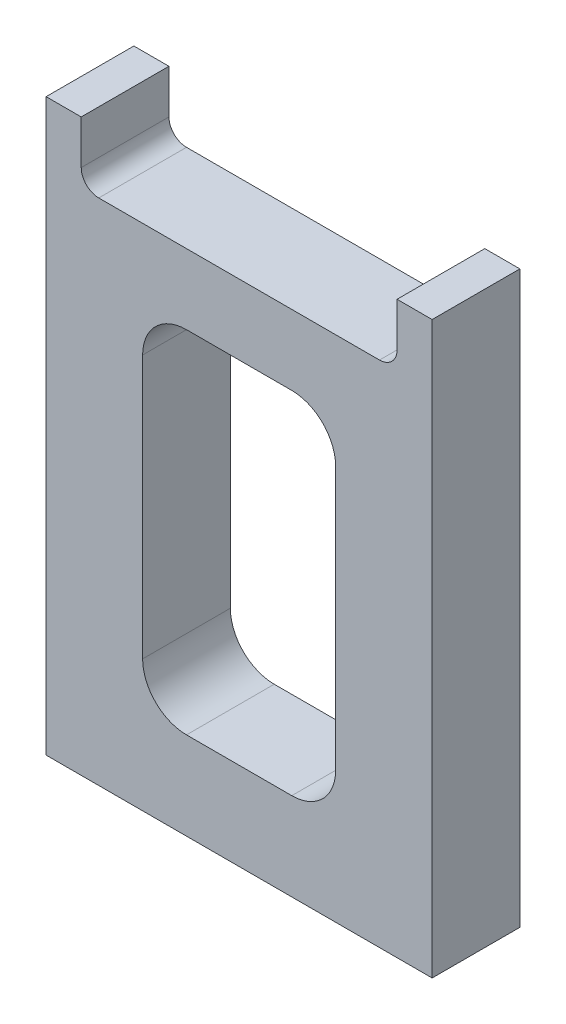
ISO-10303-21;
HEADER;
FILE_DESCRIPTION(('STEP AP214'),'2;1');
FILE_NAME('part.step','',(''),(''),'','','');
FILE_SCHEMA(('AUTOMOTIVE_DESIGN { 1 0 10303 214 1 1 1 1 }'));
ENDSEC;
DATA;
#1=APPLICATION_CONTEXT('core data for automotive mechanical design processes');
#2=APPLICATION_PROTOCOL_DEFINITION('international standard','automotive_design',2000,#1);
#3=PRODUCT_CONTEXT('',#1,'mechanical');
#4=PRODUCT('Part','Part','',(#3));
#5=PRODUCT_RELATED_PRODUCT_CATEGORY('part','',(#4));
#6=PRODUCT_DEFINITION_FORMATION('','',#4);
#7=PRODUCT_DEFINITION_CONTEXT('part definition',#1,'design');
#8=PRODUCT_DEFINITION('design','',#6,#7);
#9=PRODUCT_DEFINITION_SHAPE('','',#8);
#10=(LENGTH_UNIT() NAMED_UNIT(*) SI_UNIT(.MILLI.,.METRE.));
#11=(NAMED_UNIT(*) PLANE_ANGLE_UNIT() SI_UNIT($,.RADIAN.));
#12=(NAMED_UNIT(*) SI_UNIT($,.STERADIAN.) SOLID_ANGLE_UNIT());
#13=UNCERTAINTY_MEASURE_WITH_UNIT(LENGTH_MEASURE(1.E-05),#10,'distance_accuracy_value','');
#14=(GEOMETRIC_REPRESENTATION_CONTEXT(3) GLOBAL_UNCERTAINTY_ASSIGNED_CONTEXT((#13)) GLOBAL_UNIT_ASSIGNED_CONTEXT((#10,
#11,#12)) REPRESENTATION_CONTEXT('',''));
#15=CARTESIAN_POINT('',(0.,0.,0.));
#16=DIRECTION('',(0.,0.,1.));
#17=DIRECTION('',(1.,0.,0.));
#18=AXIS2_PLACEMENT_3D('',#15,#16,#17);
#19=CARTESIAN_POINT('',(22.,0.,10.));
#20=DIRECTION('',(-1.,0.,0.));
#21=DIRECTION('',(0.,0.,1.));
#22=AXIS2_PLACEMENT_3D('',#19,#20,#21);
#23=PLANE('',#22);
#24=DIRECTION('',(0.,1.,0.));
#25=VECTOR('',#24,1.);
#26=CARTESIAN_POINT('',(22.,0.,0.));
#27=LINE('',#26,#25);
#28=CARTESIAN_POINT('',(22.,0.,0.));
#29=VERTEX_POINT('',#28);
#30=CARTESIAN_POINT('',(22.,65.,0.));
#31=VERTEX_POINT('',#30);
#32=EDGE_CURVE('E187',#29,#31,#27,.T.);
#33=ORIENTED_EDGE('',*,*,#32,.T.);
#34=DIRECTION('',(0.,0.,-1.));
#35=VECTOR('',#34,1.);
#36=CARTESIAN_POINT('',(22.,65.,10.));
#37=LINE('',#36,#35);
#38=CARTESIAN_POINT('',(22.,65.,10.));
#39=VERTEX_POINT('',#38);
#40=EDGE_CURVE('E167',#39,#31,#37,.T.);
#41=ORIENTED_EDGE('',*,*,#40,.F.);
#42=DIRECTION('',(0.,1.,0.));
#43=VECTOR('',#42,1.);
#44=CARTESIAN_POINT('',(22.,0.,10.));
#45=LINE('',#44,#43);
#46=CARTESIAN_POINT('',(22.,0.,10.));
#47=VERTEX_POINT('',#46);
#48=EDGE_CURVE('E175',#47,#39,#45,.T.);
#49=ORIENTED_EDGE('',*,*,#48,.F.);
#50=DIRECTION('',(0.,0.,-1.));
#51=VECTOR('',#50,1.);
#52=CARTESIAN_POINT('',(22.,0.,10.));
#53=LINE('',#52,#51);
#54=EDGE_CURVE('E304',#47,#29,#53,.T.);
#55=ORIENTED_EDGE('',*,*,#54,.T.);
#56=EDGE_LOOP('',(#33,#41,#49,#55));
#57=FACE_BOUND('',#56,.T.);
#58=ADVANCED_FACE('F37',(#57),#23,.F.);
#59=CARTESIAN_POINT('',(22.,65.,10.));
#60=DIRECTION('',(0.,-1.,0.));
#61=DIRECTION('',(0.,0.,-1.));
#62=AXIS2_PLACEMENT_3D('',#59,#60,#61);
#63=PLANE('',#62);
#64=DIRECTION('',(-1.,0.,0.));
#65=VECTOR('',#64,1.);
#66=CARTESIAN_POINT('',(22.,65.,0.));
#67=LINE('',#66,#65);
#68=CARTESIAN_POINT('',(18.,65.,0.));
#69=VERTEX_POINT('',#68);
#70=EDGE_CURVE('E306',#31,#69,#67,.T.);
#71=ORIENTED_EDGE('',*,*,#70,.T.);
#72=DIRECTION('',(0.,0.,-1.));
#73=VECTOR('',#72,1.);
#74=CARTESIAN_POINT('',(18.,65.,10.));
#75=LINE('',#74,#73);
#76=CARTESIAN_POINT('',(18.,65.,10.));
#77=VERTEX_POINT('',#76);
#78=EDGE_CURVE('E170',#77,#69,#75,.T.);
#79=ORIENTED_EDGE('',*,*,#78,.F.);
#80=DIRECTION('',(-1.,0.,0.));
#81=VECTOR('',#80,1.);
#82=CARTESIAN_POINT('',(22.,65.,10.));
#83=LINE('',#82,#81);
#84=EDGE_CURVE('E163',#39,#77,#83,.T.);
#85=ORIENTED_EDGE('',*,*,#84,.F.);
#86=ORIENTED_EDGE('',*,*,#40,.T.);
#87=EDGE_LOOP('',(#71,#79,#85,#86));
#88=FACE_BOUND('',#87,.T.);
#89=ADVANCED_FACE('F165',(#88),#63,.F.);
#90=CARTESIAN_POINT('',(18.,65.,10.));
#91=DIRECTION('',(1.,0.,0.));
#92=DIRECTION('',(0.,0.,-1.));
#93=AXIS2_PLACEMENT_3D('',#90,#91,#92);
#94=PLANE('',#93);
#95=DIRECTION('',(0.,-1.,0.));
#96=VECTOR('',#95,1.);
#97=CARTESIAN_POINT('',(18.,65.,0.));
#98=LINE('',#97,#96);
#99=CARTESIAN_POINT('',(18.,60.,0.));
#100=VERTEX_POINT('',#99);
#101=EDGE_CURVE('E308',#69,#100,#98,.T.);
#102=ORIENTED_EDGE('',*,*,#101,.T.);
#103=DIRECTION('',(0.,0.,-1.));
#104=VECTOR('',#103,1.);
#105=CARTESIAN_POINT('',(18.,60.,10.));
#106=LINE('',#105,#104);
#107=CARTESIAN_POINT('',(18.,60.,10.));
#108=VERTEX_POINT('',#107);
#109=EDGE_CURVE('E198',#100,#108,#106,.F.);
#110=ORIENTED_EDGE('',*,*,#109,.T.);
#111=DIRECTION('',(0.,-1.,0.));
#112=VECTOR('',#111,1.);
#113=CARTESIAN_POINT('',(18.,65.,10.));
#114=LINE('',#113,#112);
#115=EDGE_CURVE('E174',#77,#108,#114,.T.);
#116=ORIENTED_EDGE('',*,*,#115,.F.);
#117=ORIENTED_EDGE('',*,*,#78,.T.);
#118=EDGE_LOOP('',(#102,#110,#116,#117));
#119=FACE_BOUND('',#118,.T.);
#120=ADVANCED_FACE('F347',(#119),#94,.F.);
#121=CARTESIAN_POINT('',(18.,58.,10.));
#122=DIRECTION('',(0.,-1.,0.));
#123=DIRECTION('',(0.,0.,-1.));
#124=AXIS2_PLACEMENT_3D('',#121,#122,#123);
#125=PLANE('',#124);
#126=DIRECTION('',(-1.,0.,0.));
#127=VECTOR('',#126,1.);
#128=CARTESIAN_POINT('',(18.,58.,10.));
#129=LINE('',#128,#127);
#130=CARTESIAN_POINT('',(16.,58.,10.));
#131=VERTEX_POINT('',#130);
#132=CARTESIAN_POINT('',(-16.,58.,10.));
#133=VERTEX_POINT('',#132);
#134=EDGE_CURVE('E294',#131,#133,#129,.T.);
#135=ORIENTED_EDGE('',*,*,#134,.F.);
#136=DIRECTION('',(0.,0.,-1.));
#137=VECTOR('',#136,1.);
#138=CARTESIAN_POINT('',(16.,58.,0.));
#139=LINE('',#138,#137);
#140=CARTESIAN_POINT('',(16.,58.,0.));
#141=VERTEX_POINT('',#140);
#142=EDGE_CURVE('E190',#131,#141,#139,.T.);
#143=ORIENTED_EDGE('',*,*,#142,.T.);
#144=DIRECTION('',(-1.,0.,0.));
#145=VECTOR('',#144,1.);
#146=CARTESIAN_POINT('',(18.,58.,0.));
#147=LINE('',#146,#145);
#148=CARTESIAN_POINT('',(-16.,58.,0.));
#149=VERTEX_POINT('',#148);
#150=EDGE_CURVE('E311',#141,#149,#147,.T.);
#151=ORIENTED_EDGE('',*,*,#150,.T.);
#152=DIRECTION('',(0.,0.,-1.));
#153=VECTOR('',#152,1.);
#154=CARTESIAN_POINT('',(-16.,58.,10.));
#155=LINE('',#154,#153);
#156=EDGE_CURVE('E188',#149,#133,#155,.F.);
#157=ORIENTED_EDGE('',*,*,#156,.T.);
#158=EDGE_LOOP('',(#135,#143,#151,#157));
#159=FACE_BOUND('',#158,.T.);
#160=ADVANCED_FACE('F356',(#159),#125,.F.);
#161=CARTESIAN_POINT('',(-18.,65.,10.));
#162=DIRECTION('',(-1.,0.,0.));
#163=DIRECTION('',(0.,0.,1.));
#164=AXIS2_PLACEMENT_3D('',#161,#162,#163);
#165=PLANE('',#164);
#166=DIRECTION('',(0.,1.,0.));
#167=VECTOR('',#166,1.);
#168=CARTESIAN_POINT('',(-18.,65.,10.));
#169=LINE('',#168,#167);
#170=CARTESIAN_POINT('',(-18.,60.,10.));
#171=VERTEX_POINT('',#170);
#172=CARTESIAN_POINT('',(-18.,65.,10.));
#173=VERTEX_POINT('',#172);
#174=EDGE_CURVE('E297',#171,#173,#169,.T.);
#175=ORIENTED_EDGE('',*,*,#174,.F.);
#176=DIRECTION('',(0.,0.,-1.));
#177=VECTOR('',#176,1.);
#178=CARTESIAN_POINT('',(-18.,60.,0.));
#179=LINE('',#178,#177);
#180=CARTESIAN_POINT('',(-18.,60.,0.));
#181=VERTEX_POINT('',#180);
#182=EDGE_CURVE('E200',#171,#181,#179,.T.);
#183=ORIENTED_EDGE('',*,*,#182,.T.);
#184=DIRECTION('',(0.,1.,0.));
#185=VECTOR('',#184,1.);
#186=CARTESIAN_POINT('',(-18.,65.,0.));
#187=LINE('',#186,#185);
#188=CARTESIAN_POINT('',(-18.,65.,0.));
#189=VERTEX_POINT('',#188);
#190=EDGE_CURVE('E314',#181,#189,#187,.T.);
#191=ORIENTED_EDGE('',*,*,#190,.T.);
#192=DIRECTION('',(0.,0.,-1.));
#193=VECTOR('',#192,1.);
#194=CARTESIAN_POINT('',(-18.,65.,10.));
#195=LINE('',#194,#193);
#196=EDGE_CURVE('E192',#173,#189,#195,.T.);
#197=ORIENTED_EDGE('',*,*,#196,.F.);
#198=EDGE_LOOP('',(#175,#183,#191,#197));
#199=FACE_BOUND('',#198,.T.);
#200=ADVANCED_FACE('F362',(#199),#165,.F.);
#201=CARTESIAN_POINT('',(-22.,65.,10.));
#202=DIRECTION('',(0.,-1.,0.));
#203=DIRECTION('',(0.,0.,-1.));
#204=AXIS2_PLACEMENT_3D('',#201,#202,#203);
#205=PLANE('',#204);
#206=DIRECTION('',(-1.,0.,0.));
#207=VECTOR('',#206,1.);
#208=CARTESIAN_POINT('',(-22.,65.,0.));
#209=LINE('',#208,#207);
#210=CARTESIAN_POINT('',(-22.,65.,0.));
#211=VERTEX_POINT('',#210);
#212=EDGE_CURVE('E316',#189,#211,#209,.T.);
#213=ORIENTED_EDGE('',*,*,#212,.T.);
#214=DIRECTION('',(0.,0.,-1.));
#215=VECTOR('',#214,1.);
#216=CARTESIAN_POINT('',(-22.,65.,10.));
#217=LINE('',#216,#215);
#218=CARTESIAN_POINT('',(-22.,65.,10.));
#219=VERTEX_POINT('',#218);
#220=EDGE_CURVE('E325',#219,#211,#217,.T.);
#221=ORIENTED_EDGE('',*,*,#220,.F.);
#222=DIRECTION('',(-1.,0.,0.));
#223=VECTOR('',#222,1.);
#224=CARTESIAN_POINT('',(-22.,65.,10.));
#225=LINE('',#224,#223);
#226=EDGE_CURVE('E299',#173,#219,#225,.T.);
#227=ORIENTED_EDGE('',*,*,#226,.F.);
#228=ORIENTED_EDGE('',*,*,#196,.T.);
#229=EDGE_LOOP('',(#213,#221,#227,#228));
#230=FACE_BOUND('',#229,.T.);
#231=ADVANCED_FACE('F332',(#230),#205,.F.);
#232=CARTESIAN_POINT('',(-22.,0.,10.));
#233=DIRECTION('',(1.,0.,0.));
#234=DIRECTION('',(0.,0.,-1.));
#235=AXIS2_PLACEMENT_3D('',#232,#233,#234);
#236=PLANE('',#235);
#237=DIRECTION('',(0.,-1.,0.));
#238=VECTOR('',#237,1.);
#239=CARTESIAN_POINT('',(-22.,0.,0.));
#240=LINE('',#239,#238);
#241=CARTESIAN_POINT('',(-22.,0.,0.));
#242=VERTEX_POINT('',#241);
#243=EDGE_CURVE('E318',#211,#242,#240,.T.);
#244=ORIENTED_EDGE('',*,*,#243,.T.);
#245=DIRECTION('',(0.,0.,-1.));
#246=VECTOR('',#245,1.);
#247=CARTESIAN_POINT('',(-22.,0.,10.));
#248=LINE('',#247,#246);
#249=CARTESIAN_POINT('',(-22.,0.,10.));
#250=VERTEX_POINT('',#249);
#251=EDGE_CURVE('E322',#250,#242,#248,.T.);
#252=ORIENTED_EDGE('',*,*,#251,.F.);
#253=DIRECTION('',(0.,-1.,0.));
#254=VECTOR('',#253,1.);
#255=CARTESIAN_POINT('',(-22.,0.,10.));
#256=LINE('',#255,#254);
#257=EDGE_CURVE('E301',#219,#250,#256,.T.);
#258=ORIENTED_EDGE('',*,*,#257,.F.);
#259=ORIENTED_EDGE('',*,*,#220,.T.);
#260=EDGE_LOOP('',(#244,#252,#258,#259));
#261=FACE_BOUND('',#260,.T.);
#262=ADVANCED_FACE('F341',(#261),#236,.F.);
#263=CARTESIAN_POINT('',(-22.,0.,10.));
#264=DIRECTION('',(0.,1.,0.));
#265=DIRECTION('',(0.,0.,1.));
#266=AXIS2_PLACEMENT_3D('',#263,#264,#265);
#267=PLANE('',#266);
#268=CARTESIAN_POINT('',(-15.,0.,5.));
#269=DIRECTION('',(0.,-1.,0.));
#270=DIRECTION('',(0.,0.,1.));
#271=AXIS2_PLACEMENT_3D('',#268,#269,#270);
#272=CIRCLE('',#271,2.);
#273=CARTESIAN_POINT('',(-15.,0.,7.));
#274=VERTEX_POINT('',#273);
#275=EDGE_CURVE('E276',#274,#274,#272,.T.);
#276=ORIENTED_EDGE('',*,*,#275,.F.);
#277=EDGE_LOOP('',(#276));
#278=FACE_BOUND('',#277,.T.);
#279=CARTESIAN_POINT('',(15.,0.,5.));
#280=DIRECTION('',(0.,-1.,0.));
#281=DIRECTION('',(0.,0.,-1.));
#282=AXIS2_PLACEMENT_3D('',#279,#280,#281);
#283=CIRCLE('',#282,2.);
#284=CARTESIAN_POINT('',(15.,0.,3.));
#285=VERTEX_POINT('',#284);
#286=EDGE_CURVE('E285',#285,#285,#283,.T.);
#287=ORIENTED_EDGE('',*,*,#286,.F.);
#288=EDGE_LOOP('',(#287));
#289=FACE_BOUND('',#288,.T.);
#290=DIRECTION('',(1.,0.,0.));
#291=VECTOR('',#290,1.);
#292=CARTESIAN_POINT('',(-22.,0.,0.));
#293=LINE('',#292,#291);
#294=EDGE_CURVE('E184',#242,#29,#293,.T.);
#295=ORIENTED_EDGE('',*,*,#294,.T.);
#296=ORIENTED_EDGE('',*,*,#54,.F.);
#297=DIRECTION('',(1.,0.,0.));
#298=VECTOR('',#297,1.);
#299=CARTESIAN_POINT('',(-22.,0.,10.));
#300=LINE('',#299,#298);
#301=EDGE_CURVE('E180',#250,#47,#300,.T.);
#302=ORIENTED_EDGE('',*,*,#301,.F.);
#303=ORIENTED_EDGE('',*,*,#251,.T.);
#304=EDGE_LOOP('',(#295,#296,#302,#303));
#305=FACE_BOUND('',#304,.T.);
#306=ADVANCED_FACE('F344',(#278,#289,#305),#267,.F.);
#307=CARTESIAN_POINT('',(0.,0.,10.));
#308=DIRECTION('',(0.,0.,1.));
#309=DIRECTION('',(1.,0.,0.));
#310=AXIS2_PLACEMENT_3D('',#307,#308,#309);
#311=PLANE('',#310);
#312=DIRECTION('',(1.,0.,0.));
#313=VECTOR('',#312,1.);
#314=CARTESIAN_POINT('',(11.,50.,10.));
#315=LINE('',#314,#313);
#316=CARTESIAN_POINT('',(-6.,50.,10.));
#317=VERTEX_POINT('',#316);
#318=CARTESIAN_POINT('',(6.,50.,10.));
#319=VERTEX_POINT('',#318);
#320=EDGE_CURVE('E265',#317,#319,#315,.T.);
#321=ORIENTED_EDGE('',*,*,#320,.T.);
#322=CARTESIAN_POINT('',(6.,45.,10.));
#323=DIRECTION('',(0.,0.,1.));
#324=DIRECTION('',(1.,0.,0.));
#325=AXIS2_PLACEMENT_3D('',#322,#323,#324);
#326=CIRCLE('',#325,5.);
#327=CARTESIAN_POINT('',(11.,45.,10.));
#328=VERTEX_POINT('',#327);
#329=EDGE_CURVE('E11',#319,#328,#326,.F.);
#330=ORIENTED_EDGE('',*,*,#329,.T.);
#331=DIRECTION('',(0.,-1.,0.));
#332=VECTOR('',#331,1.);
#333=CARTESIAN_POINT('',(11.,50.,10.));
#334=LINE('',#333,#332);
#335=CARTESIAN_POINT('',(11.,15.,10.));
#336=VERTEX_POINT('',#335);
#337=EDGE_CURVE('E258',#328,#336,#334,.T.);
#338=ORIENTED_EDGE('',*,*,#337,.T.);
#339=CARTESIAN_POINT('',(6.,15.,10.));
#340=DIRECTION('',(0.,0.,1.));
#341=DIRECTION('',(1.,0.,0.));
#342=AXIS2_PLACEMENT_3D('',#339,#340,#341);
#343=CIRCLE('',#342,5.);
#344=CARTESIAN_POINT('',(6.,10.,10.));
#345=VERTEX_POINT('',#344);
#346=EDGE_CURVE('E232',#336,#345,#343,.F.);
#347=ORIENTED_EDGE('',*,*,#346,.T.);
#348=DIRECTION('',(-1.,0.,0.));
#349=VECTOR('',#348,1.);
#350=CARTESIAN_POINT('',(11.,10.,10.));
#351=LINE('',#350,#349);
#352=CARTESIAN_POINT('',(-6.,10.,10.));
#353=VERTEX_POINT('',#352);
#354=EDGE_CURVE('E269',#345,#353,#351,.T.);
#355=ORIENTED_EDGE('',*,*,#354,.T.);
#356=CARTESIAN_POINT('',(-6.,15.,10.));
#357=DIRECTION('',(0.,0.,1.));
#358=DIRECTION('',(1.,0.,0.));
#359=AXIS2_PLACEMENT_3D('',#356,#357,#358);
#360=CIRCLE('',#359,5.);
#361=CARTESIAN_POINT('',(-11.,15.,10.));
#362=VERTEX_POINT('',#361);
#363=EDGE_CURVE('E59',#353,#362,#360,.F.);
#364=ORIENTED_EDGE('',*,*,#363,.T.);
#365=DIRECTION('',(0.,1.,0.));
#366=VECTOR('',#365,1.);
#367=CARTESIAN_POINT('',(-11.,50.,10.));
#368=LINE('',#367,#366);
#369=CARTESIAN_POINT('',(-11.,45.,10.));
#370=VERTEX_POINT('',#369);
#371=EDGE_CURVE('E271',#362,#370,#368,.T.);
#372=ORIENTED_EDGE('',*,*,#371,.T.);
#373=CARTESIAN_POINT('',(-6.,45.,10.));
#374=DIRECTION('',(0.,0.,1.));
#375=DIRECTION('',(1.,0.,0.));
#376=AXIS2_PLACEMENT_3D('',#373,#374,#375);
#377=CIRCLE('',#376,5.);
#378=EDGE_CURVE('E236',#370,#317,#377,.F.);
#379=ORIENTED_EDGE('',*,*,#378,.T.);
#380=EDGE_LOOP('',(#321,#330,#338,#347,#355,#364,#372,#379));
#381=FACE_BOUND('',#380,.T.);
#382=ORIENTED_EDGE('',*,*,#48,.T.);
#383=ORIENTED_EDGE('',*,*,#84,.T.);
#384=ORIENTED_EDGE('',*,*,#115,.T.);
#385=CARTESIAN_POINT('',(16.,60.,10.));
#386=DIRECTION('',(0.,0.,1.));
#387=DIRECTION('',(1.,0.,0.));
#388=AXIS2_PLACEMENT_3D('',#385,#386,#387);
#389=CIRCLE('',#388,2.);
#390=EDGE_CURVE('E205',#108,#131,#389,.F.);
#391=ORIENTED_EDGE('',*,*,#390,.T.);
#392=ORIENTED_EDGE('',*,*,#134,.T.);
#393=CARTESIAN_POINT('',(-16.,60.,10.));
#394=DIRECTION('',(0.,0.,1.));
#395=DIRECTION('',(1.,0.,0.));
#396=AXIS2_PLACEMENT_3D('',#393,#394,#395);
#397=CIRCLE('',#396,2.);
#398=EDGE_CURVE('E209',#133,#171,#397,.F.);
#399=ORIENTED_EDGE('',*,*,#398,.T.);
#400=ORIENTED_EDGE('',*,*,#174,.T.);
#401=ORIENTED_EDGE('',*,*,#226,.T.);
#402=ORIENTED_EDGE('',*,*,#257,.T.);
#403=ORIENTED_EDGE('',*,*,#301,.T.);
#404=EDGE_LOOP('',(#382,#383,#384,#391,#392,#399,#400,#401,#402,#403));
#405=FACE_BOUND('',#404,.T.);
#406=ADVANCED_FACE('F178',(#381,#405),#311,.T.);
#407=CARTESIAN_POINT('',(0.,0.,0.));
#408=DIRECTION('',(0.,0.,1.));
#409=DIRECTION('',(1.,0.,0.));
#410=AXIS2_PLACEMENT_3D('',#407,#408,#409);
#411=PLANE('',#410);
#412=DIRECTION('',(-1.,0.,0.));
#413=VECTOR('',#412,1.);
#414=CARTESIAN_POINT('',(11.,10.,0.));
#415=LINE('',#414,#413);
#416=CARTESIAN_POINT('',(6.,10.,0.));
#417=VERTEX_POINT('',#416);
#418=CARTESIAN_POINT('',(-6.,10.,0.));
#419=VERTEX_POINT('',#418);
#420=EDGE_CURVE('E278',#417,#419,#415,.T.);
#421=ORIENTED_EDGE('',*,*,#420,.F.);
#422=CARTESIAN_POINT('',(6.,15.,0.));
#423=DIRECTION('',(0.,0.,1.));
#424=DIRECTION('',(1.,0.,0.));
#425=AXIS2_PLACEMENT_3D('',#422,#423,#424);
#426=CIRCLE('',#425,5.);
#427=CARTESIAN_POINT('',(11.,15.,0.));
#428=VERTEX_POINT('',#427);
#429=EDGE_CURVE('E230',#417,#428,#426,.T.);
#430=ORIENTED_EDGE('',*,*,#429,.T.);
#431=DIRECTION('',(0.,-1.,0.));
#432=VECTOR('',#431,1.);
#433=CARTESIAN_POINT('',(11.,50.,0.));
#434=LINE('',#433,#432);
#435=CARTESIAN_POINT('',(11.,45.,0.));
#436=VERTEX_POINT('',#435);
#437=EDGE_CURVE('E249',#436,#428,#434,.T.);
#438=ORIENTED_EDGE('',*,*,#437,.F.);
#439=CARTESIAN_POINT('',(6.,45.,0.));
#440=DIRECTION('',(0.,0.,1.));
#441=DIRECTION('',(1.,0.,0.));
#442=AXIS2_PLACEMENT_3D('',#439,#440,#441);
#443=CIRCLE('',#442,5.);
#444=CARTESIAN_POINT('',(6.,50.,0.));
#445=VERTEX_POINT('',#444);
#446=EDGE_CURVE('E45',#436,#445,#443,.T.);
#447=ORIENTED_EDGE('',*,*,#446,.T.);
#448=DIRECTION('',(1.,0.,0.));
#449=VECTOR('',#448,1.);
#450=CARTESIAN_POINT('',(11.,50.,0.));
#451=LINE('',#450,#449);
#452=CARTESIAN_POINT('',(-6.,50.,0.));
#453=VERTEX_POINT('',#452);
#454=EDGE_CURVE('E247',#453,#445,#451,.T.);
#455=ORIENTED_EDGE('',*,*,#454,.F.);
#456=CARTESIAN_POINT('',(-6.,45.,0.));
#457=DIRECTION('',(0.,0.,1.));
#458=DIRECTION('',(1.,0.,0.));
#459=AXIS2_PLACEMENT_3D('',#456,#457,#458);
#460=CIRCLE('',#459,5.);
#461=CARTESIAN_POINT('',(-11.,45.,0.));
#462=VERTEX_POINT('',#461);
#463=EDGE_CURVE('E234',#453,#462,#460,.T.);
#464=ORIENTED_EDGE('',*,*,#463,.T.);
#465=DIRECTION('',(0.,1.,0.));
#466=VECTOR('',#465,1.);
#467=CARTESIAN_POINT('',(-11.,50.,0.));
#468=LINE('',#467,#466);
#469=CARTESIAN_POINT('',(-11.,15.,0.));
#470=VERTEX_POINT('',#469);
#471=EDGE_CURVE('E259',#470,#462,#468,.T.);
#472=ORIENTED_EDGE('',*,*,#471,.F.);
#473=CARTESIAN_POINT('',(-6.,15.,0.));
#474=DIRECTION('',(0.,0.,1.));
#475=DIRECTION('',(1.,0.,0.));
#476=AXIS2_PLACEMENT_3D('',#473,#474,#475);
#477=CIRCLE('',#476,5.);
#478=EDGE_CURVE('E238',#470,#419,#477,.T.);
#479=ORIENTED_EDGE('',*,*,#478,.T.);
#480=EDGE_LOOP('',(#421,#430,#438,#447,#455,#464,#472,#479));
#481=FACE_BOUND('',#480,.T.);
#482=ORIENTED_EDGE('',*,*,#32,.F.);
#483=ORIENTED_EDGE('',*,*,#294,.F.);
#484=ORIENTED_EDGE('',*,*,#243,.F.);
#485=ORIENTED_EDGE('',*,*,#212,.F.);
#486=ORIENTED_EDGE('',*,*,#190,.F.);
#487=CARTESIAN_POINT('',(-16.,60.,0.));
#488=DIRECTION('',(0.,0.,1.));
#489=DIRECTION('',(1.,0.,0.));
#490=AXIS2_PLACEMENT_3D('',#487,#488,#489);
#491=CIRCLE('',#490,2.);
#492=EDGE_CURVE('E207',#181,#149,#491,.T.);
#493=ORIENTED_EDGE('',*,*,#492,.T.);
#494=ORIENTED_EDGE('',*,*,#150,.F.);
#495=CARTESIAN_POINT('',(16.,60.,0.));
#496=DIRECTION('',(0.,0.,1.));
#497=DIRECTION('',(1.,0.,0.));
#498=AXIS2_PLACEMENT_3D('',#495,#496,#497);
#499=CIRCLE('',#498,2.);
#500=EDGE_CURVE('E203',#141,#100,#499,.T.);
#501=ORIENTED_EDGE('',*,*,#500,.T.);
#502=ORIENTED_EDGE('',*,*,#101,.F.);
#503=ORIENTED_EDGE('',*,*,#70,.F.);
#504=EDGE_LOOP('',(#482,#483,#484,#485,#486,#493,#494,#501,#502,#503));
#505=FACE_BOUND('',#504,.T.);
#506=ADVANCED_FACE('F245',(#481,#505),#411,.F.);
#507=CARTESIAN_POINT('',(15.,10.,5.));
#508=DIRECTION('',(0.,-1.,0.));
#509=DIRECTION('',(0.,0.,-1.));
#510=AXIS2_PLACEMENT_3D('',#507,#508,#509);
#511=CYLINDRICAL_SURFACE('',#510,2.);
#512=CARTESIAN_POINT('',(15.,10.,5.));
#513=DIRECTION('',(0.,-1.,0.));
#514=DIRECTION('',(0.,0.,-1.));
#515=AXIS2_PLACEMENT_3D('',#512,#513,#514);
#516=CIRCLE('',#515,2.);
#517=CARTESIAN_POINT('',(15.,10.,3.));
#518=VERTEX_POINT('',#517);
#519=EDGE_CURVE('E288',#518,#518,#516,.T.);
#520=ORIENTED_EDGE('',*,*,#519,.F.);
#521=EDGE_LOOP('',(#520));
#522=FACE_BOUND('',#521,.T.);
#523=ORIENTED_EDGE('',*,*,#286,.T.);
#524=EDGE_LOOP('',(#523));
#525=FACE_BOUND('',#524,.T.);
#526=ADVANCED_FACE('F426',(#522,#525),#511,.F.);
#527=CARTESIAN_POINT('',(15.,10.,5.));
#528=DIRECTION('',(0.,-1.,0.));
#529=DIRECTION('',(0.,0.,-1.));
#530=AXIS2_PLACEMENT_3D('',#527,#528,#529);
#531=PLANE('',#530);
#532=ORIENTED_EDGE('',*,*,#519,.T.);
#533=EDGE_LOOP('',(#532));
#534=FACE_BOUND('',#533,.T.);
#535=ADVANCED_FACE('F422',(#534),#531,.T.);
#536=CARTESIAN_POINT('',(-15.,10.,5.));
#537=DIRECTION('',(0.,-1.,0.));
#538=DIRECTION('',(0.,0.,-1.));
#539=AXIS2_PLACEMENT_3D('',#536,#537,#538);
#540=CYLINDRICAL_SURFACE('',#539,2.);
#541=CARTESIAN_POINT('',(-15.,10.,5.));
#542=DIRECTION('',(0.,-1.,0.));
#543=DIRECTION('',(0.,0.,1.));
#544=AXIS2_PLACEMENT_3D('',#541,#542,#543);
#545=CIRCLE('',#544,2.);
#546=CARTESIAN_POINT('',(-15.,10.,7.));
#547=VERTEX_POINT('',#546);
#548=EDGE_CURVE('E282',#547,#547,#545,.T.);
#549=ORIENTED_EDGE('',*,*,#548,.F.);
#550=EDGE_LOOP('',(#549));
#551=FACE_BOUND('',#550,.T.);
#552=ORIENTED_EDGE('',*,*,#275,.T.);
#553=EDGE_LOOP('',(#552));
#554=FACE_BOUND('',#553,.T.);
#555=ADVANCED_FACE('F418',(#551,#554),#540,.F.);
#556=CARTESIAN_POINT('',(-15.,10.,5.));
#557=DIRECTION('',(0.,1.,0.));
#558=DIRECTION('',(0.,0.,1.));
#559=AXIS2_PLACEMENT_3D('',#556,#557,#558);
#560=PLANE('',#559);
#561=ORIENTED_EDGE('',*,*,#548,.T.);
#562=EDGE_LOOP('',(#561));
#563=FACE_BOUND('',#562,.T.);
#564=ADVANCED_FACE('F381',(#563),#560,.F.);
#565=CARTESIAN_POINT('',(16.,60.,10.));
#566=DIRECTION('',(0.,0.,1.));
#567=DIRECTION('',(1.,0.,0.));
#568=AXIS2_PLACEMENT_3D('',#565,#566,#567);
#569=CYLINDRICAL_SURFACE('',#568,2.);
#570=ORIENTED_EDGE('',*,*,#390,.F.);
#571=ORIENTED_EDGE('',*,*,#109,.F.);
#572=ORIENTED_EDGE('',*,*,#500,.F.);
#573=ORIENTED_EDGE('',*,*,#142,.F.);
#574=EDGE_LOOP('',(#570,#571,#572,#573));
#575=FACE_BOUND('',#574,.T.);
#576=ADVANCED_FACE('F353',(#575),#569,.F.);
#577=CARTESIAN_POINT('',(-16.,60.,10.));
#578=DIRECTION('',(0.,0.,1.));
#579=DIRECTION('',(1.,0.,0.));
#580=AXIS2_PLACEMENT_3D('',#577,#578,#579);
#581=CYLINDRICAL_SURFACE('',#580,2.);
#582=ORIENTED_EDGE('',*,*,#398,.F.);
#583=ORIENTED_EDGE('',*,*,#156,.F.);
#584=ORIENTED_EDGE('',*,*,#492,.F.);
#585=ORIENTED_EDGE('',*,*,#182,.F.);
#586=EDGE_LOOP('',(#582,#583,#584,#585));
#587=FACE_BOUND('',#586,.T.);
#588=ADVANCED_FACE('F361',(#587),#581,.F.);
#589=CARTESIAN_POINT('',(11.,50.,10.));
#590=DIRECTION('',(1.,0.,0.));
#591=DIRECTION('',(0.,1.,0.));
#592=AXIS2_PLACEMENT_3D('',#589,#590,#591);
#593=PLANE('',#592);
#594=ORIENTED_EDGE('',*,*,#437,.T.);
#595=DIRECTION('',(0.,0.,-1.));
#596=VECTOR('',#595,1.);
#597=CARTESIAN_POINT('',(11.,15.,10.));
#598=LINE('',#597,#596);
#599=EDGE_CURVE('E219',#428,#336,#598,.F.);
#600=ORIENTED_EDGE('',*,*,#599,.T.);
#601=ORIENTED_EDGE('',*,*,#337,.F.);
#602=DIRECTION('',(0.,0.,-1.));
#603=VECTOR('',#602,1.);
#604=CARTESIAN_POINT('',(11.,45.,0.));
#605=LINE('',#604,#603);
#606=EDGE_CURVE('E216',#328,#436,#605,.T.);
#607=ORIENTED_EDGE('',*,*,#606,.T.);
#608=EDGE_LOOP('',(#594,#600,#601,#607));
#609=FACE_BOUND('',#608,.T.);
#610=ADVANCED_FACE('F267',(#609),#593,.F.);
#611=CARTESIAN_POINT('',(11.,50.,10.));
#612=DIRECTION('',(0.,1.,0.));
#613=DIRECTION('',(0.,0.,1.));
#614=AXIS2_PLACEMENT_3D('',#611,#612,#613);
#615=PLANE('',#614);
#616=ORIENTED_EDGE('',*,*,#320,.F.);
#617=DIRECTION('',(0.,0.,-1.));
#618=VECTOR('',#617,1.);
#619=CARTESIAN_POINT('',(-6.,50.,0.));
#620=LINE('',#619,#618);
#621=EDGE_CURVE('E223',#317,#453,#620,.T.);
#622=ORIENTED_EDGE('',*,*,#621,.T.);
#623=ORIENTED_EDGE('',*,*,#454,.T.);
#624=DIRECTION('',(0.,0.,-1.));
#625=VECTOR('',#624,1.);
#626=CARTESIAN_POINT('',(6.,50.,10.));
#627=LINE('',#626,#625);
#628=EDGE_CURVE('E221',#445,#319,#627,.F.);
#629=ORIENTED_EDGE('',*,*,#628,.T.);
#630=EDGE_LOOP('',(#616,#622,#623,#629));
#631=FACE_BOUND('',#630,.T.);
#632=ADVANCED_FACE('F255',(#631),#615,.F.);
#633=CARTESIAN_POINT('',(-11.,50.,10.));
#634=DIRECTION('',(-1.,0.,0.));
#635=DIRECTION('',(0.,0.,1.));
#636=AXIS2_PLACEMENT_3D('',#633,#634,#635);
#637=PLANE('',#636);
#638=ORIENTED_EDGE('',*,*,#471,.T.);
#639=DIRECTION('',(0.,0.,-1.));
#640=VECTOR('',#639,1.);
#641=CARTESIAN_POINT('',(-11.,45.,10.));
#642=LINE('',#641,#640);
#643=EDGE_CURVE('E52',#462,#370,#642,.F.);
#644=ORIENTED_EDGE('',*,*,#643,.T.);
#645=ORIENTED_EDGE('',*,*,#371,.F.);
#646=DIRECTION('',(0.,0.,-1.));
#647=VECTOR('',#646,1.);
#648=CARTESIAN_POINT('',(-11.,15.,0.));
#649=LINE('',#648,#647);
#650=EDGE_CURVE('E226',#362,#470,#649,.T.);
#651=ORIENTED_EDGE('',*,*,#650,.T.);
#652=EDGE_LOOP('',(#638,#644,#645,#651));
#653=FACE_BOUND('',#652,.T.);
#654=ADVANCED_FACE('F401',(#653),#637,.F.);
#655=CARTESIAN_POINT('',(11.,10.,10.));
#656=DIRECTION('',(0.,-1.,0.));
#657=DIRECTION('',(0.,0.,-1.));
#658=AXIS2_PLACEMENT_3D('',#655,#656,#657);
#659=PLANE('',#658);
#660=ORIENTED_EDGE('',*,*,#354,.F.);
#661=DIRECTION('',(0.,0.,-1.));
#662=VECTOR('',#661,1.);
#663=CARTESIAN_POINT('',(6.,10.,0.));
#664=LINE('',#663,#662);
#665=EDGE_CURVE('E213',#345,#417,#664,.T.);
#666=ORIENTED_EDGE('',*,*,#665,.T.);
#667=ORIENTED_EDGE('',*,*,#420,.T.);
#668=DIRECTION('',(0.,0.,-1.));
#669=VECTOR('',#668,1.);
#670=CARTESIAN_POINT('',(-6.,10.,10.));
#671=LINE('',#670,#669);
#672=EDGE_CURVE('E211',#419,#353,#671,.F.);
#673=ORIENTED_EDGE('',*,*,#672,.T.);
#674=EDGE_LOOP('',(#660,#666,#667,#673));
#675=FACE_BOUND('',#674,.T.);
#676=ADVANCED_FACE('F388',(#675),#659,.F.);
#677=CARTESIAN_POINT('',(6.,15.,10.));
#678=DIRECTION('',(0.,0.,1.));
#679=DIRECTION('',(1.,0.,0.));
#680=AXIS2_PLACEMENT_3D('',#677,#678,#679);
#681=CYLINDRICAL_SURFACE('',#680,5.);
#682=ORIENTED_EDGE('',*,*,#346,.F.);
#683=ORIENTED_EDGE('',*,*,#599,.F.);
#684=ORIENTED_EDGE('',*,*,#429,.F.);
#685=ORIENTED_EDGE('',*,*,#665,.F.);
#686=EDGE_LOOP('',(#682,#683,#684,#685));
#687=FACE_BOUND('',#686,.T.);
#688=ADVANCED_FACE('F384',(#687),#681,.F.);
#689=CARTESIAN_POINT('',(-6.,45.,10.));
#690=DIRECTION('',(0.,0.,1.));
#691=DIRECTION('',(1.,0.,0.));
#692=AXIS2_PLACEMENT_3D('',#689,#690,#691);
#693=CYLINDRICAL_SURFACE('',#692,5.);
#694=ORIENTED_EDGE('',*,*,#378,.F.);
#695=ORIENTED_EDGE('',*,*,#643,.F.);
#696=ORIENTED_EDGE('',*,*,#463,.F.);
#697=ORIENTED_EDGE('',*,*,#621,.F.);
#698=EDGE_LOOP('',(#694,#695,#696,#697));
#699=FACE_BOUND('',#698,.T.);
#700=ADVANCED_FACE('F387',(#699),#693,.F.);
#701=CARTESIAN_POINT('',(-6.,15.,10.));
#702=DIRECTION('',(0.,0.,1.));
#703=DIRECTION('',(1.,0.,0.));
#704=AXIS2_PLACEMENT_3D('',#701,#702,#703);
#705=CYLINDRICAL_SURFACE('',#704,5.);
#706=ORIENTED_EDGE('',*,*,#363,.F.);
#707=ORIENTED_EDGE('',*,*,#672,.F.);
#708=ORIENTED_EDGE('',*,*,#478,.F.);
#709=ORIENTED_EDGE('',*,*,#650,.F.);
#710=EDGE_LOOP('',(#706,#707,#708,#709));
#711=FACE_BOUND('',#710,.T.);
#712=ADVANCED_FACE('F391',(#711),#705,.F.);
#713=CARTESIAN_POINT('',(6.,45.,10.));
#714=DIRECTION('',(0.,0.,1.));
#715=DIRECTION('',(1.,0.,0.));
#716=AXIS2_PLACEMENT_3D('',#713,#714,#715);
#717=CYLINDRICAL_SURFACE('',#716,5.);
#718=ORIENTED_EDGE('',*,*,#329,.F.);
#719=ORIENTED_EDGE('',*,*,#628,.F.);
#720=ORIENTED_EDGE('',*,*,#446,.F.);
#721=ORIENTED_EDGE('',*,*,#606,.F.);
#722=EDGE_LOOP('',(#718,#719,#720,#721));
#723=FACE_BOUND('',#722,.T.);
#724=ADVANCED_FACE('F39',(#723),#717,.F.);
#725=CLOSED_SHELL('',(#58,#89,#120,#160,#200,#231,#262,#306,#406,#506,#526,#535,#555,#564,#576,
#588,#610,#632,#654,#676,#688,#700,#712,#724));
#726=MANIFOLD_SOLID_BREP('B2',#725);
#727=ADVANCED_BREP_SHAPE_REPRESENTATION('',(#18,#726),#14);
#728=SHAPE_DEFINITION_REPRESENTATION(#9,#727);
ENDSEC;
END-ISO-10303-21;
